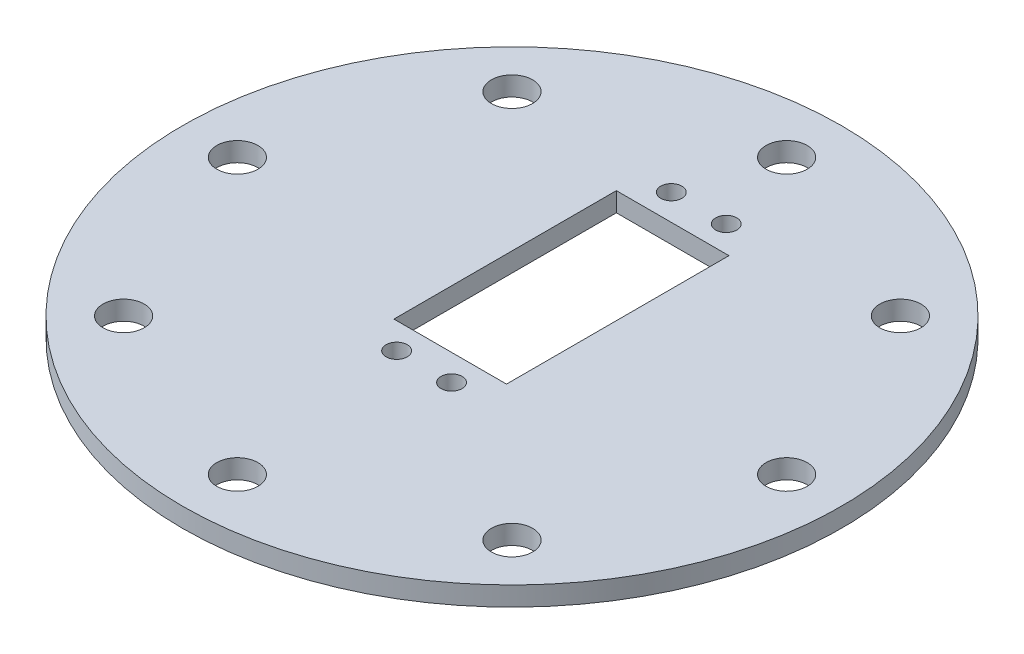
ISO-10303-21;
HEADER;
FILE_DESCRIPTION(('STEP AP214'),'2;1');
FILE_NAME('part.step','',(''),(''),'','','');
FILE_SCHEMA(('AUTOMOTIVE_DESIGN { 1 0 10303 214 1 1 1 1 }'));
ENDSEC;
DATA;
#1=APPLICATION_CONTEXT('core data for automotive mechanical design processes');
#2=APPLICATION_PROTOCOL_DEFINITION('international standard','automotive_design',2000,#1);
#3=PRODUCT_CONTEXT('',#1,'mechanical');
#4=PRODUCT('Part','Part','',(#3));
#5=PRODUCT_RELATED_PRODUCT_CATEGORY('part','',(#4));
#6=PRODUCT_DEFINITION_FORMATION('','',#4);
#7=PRODUCT_DEFINITION_CONTEXT('part definition',#1,'design');
#8=PRODUCT_DEFINITION('design','',#6,#7);
#9=PRODUCT_DEFINITION_SHAPE('','',#8);
#10=(LENGTH_UNIT() NAMED_UNIT(*) SI_UNIT(.MILLI.,.METRE.));
#11=(NAMED_UNIT(*) PLANE_ANGLE_UNIT() SI_UNIT($,.RADIAN.));
#12=(NAMED_UNIT(*) SI_UNIT($,.STERADIAN.) SOLID_ANGLE_UNIT());
#13=UNCERTAINTY_MEASURE_WITH_UNIT(LENGTH_MEASURE(1.E-05),#10,'distance_accuracy_value','');
#14=(GEOMETRIC_REPRESENTATION_CONTEXT(3) GLOBAL_UNCERTAINTY_ASSIGNED_CONTEXT((#13)) GLOBAL_UNIT_ASSIGNED_CONTEXT((#10,
#11,#12)) REPRESENTATION_CONTEXT('',''));
#15=CARTESIAN_POINT('',(0.,0.,0.));
#16=DIRECTION('',(0.,0.,1.));
#17=DIRECTION('',(1.,0.,0.));
#18=AXIS2_PLACEMENT_3D('',#15,#16,#17);
#19=CARTESIAN_POINT('',(0.,3.5,0.));
#20=DIRECTION('',(0.,-1.,0.));
#21=DIRECTION('',(0.,0.,-1.));
#22=AXIS2_PLACEMENT_3D('',#19,#20,#21);
#23=CYLINDRICAL_SURFACE('',#22,60.);
#24=CARTESIAN_POINT('',(0.,3.5,0.));
#25=DIRECTION('',(0.,1.,0.));
#26=DIRECTION('',(0.,0.,1.));
#27=AXIS2_PLACEMENT_3D('',#24,#25,#26);
#28=CIRCLE('',#27,60.);
#29=CARTESIAN_POINT('',(0.,3.5,60.));
#30=VERTEX_POINT('',#29);
#31=EDGE_CURVE('E11',#30,#30,#28,.T.);
#32=ORIENTED_EDGE('',*,*,#31,.F.);
#33=EDGE_LOOP('',(#32));
#34=FACE_BOUND('',#33,.T.);
#35=CARTESIAN_POINT('',(0.,0.,0.));
#36=DIRECTION('',(0.,1.,0.));
#37=DIRECTION('',(0.,0.,1.));
#38=AXIS2_PLACEMENT_3D('',#35,#36,#37);
#39=CIRCLE('',#38,60.);
#40=CARTESIAN_POINT('',(0.,0.,60.));
#41=VERTEX_POINT('',#40);
#42=EDGE_CURVE('E46',#41,#41,#39,.T.);
#43=ORIENTED_EDGE('',*,*,#42,.T.);
#44=EDGE_LOOP('',(#43));
#45=FACE_BOUND('',#44,.T.);
#46=ADVANCED_FACE('F43',(#34,#45),#23,.T.);
#47=CARTESIAN_POINT('',(0.,3.5,0.));
#48=DIRECTION('',(0.,1.,0.));
#49=DIRECTION('',(0.,0.,1.));
#50=AXIS2_PLACEMENT_3D('',#47,#48,#49);
#51=PLANE('',#50);
#52=DIRECTION('',(0.,0.,-1.));
#53=VECTOR('',#52,1.);
#54=CARTESIAN_POINT('',(10.25,3.5,-29.25));
#55=LINE('',#54,#53);
#56=CARTESIAN_POINT('',(10.25,3.5,11.25));
#57=VERTEX_POINT('',#56);
#58=CARTESIAN_POINT('',(10.25,3.5,-29.25));
#59=VERTEX_POINT('',#58);
#60=EDGE_CURVE('E58',#57,#59,#55,.T.);
#61=ORIENTED_EDGE('',*,*,#60,.F.);
#62=DIRECTION('',(1.,0.,0.));
#63=VECTOR('',#62,1.);
#64=CARTESIAN_POINT('',(-10.25,3.5,11.25));
#65=LINE('',#64,#63);
#66=CARTESIAN_POINT('',(-10.25,3.5,11.25));
#67=VERTEX_POINT('',#66);
#68=EDGE_CURVE('E93',#67,#57,#65,.T.);
#69=ORIENTED_EDGE('',*,*,#68,.F.);
#70=DIRECTION('',(0.,0.,1.));
#71=VECTOR('',#70,1.);
#72=CARTESIAN_POINT('',(-10.25,3.5,-29.25));
#73=LINE('',#72,#71);
#74=CARTESIAN_POINT('',(-10.25,3.5,-29.25));
#75=VERTEX_POINT('',#74);
#76=EDGE_CURVE('E118',#75,#67,#73,.T.);
#77=ORIENTED_EDGE('',*,*,#76,.F.);
#78=DIRECTION('',(-1.,0.,0.));
#79=VECTOR('',#78,1.);
#80=CARTESIAN_POINT('',(-10.25,3.5,-29.25));
#81=LINE('',#80,#79);
#82=EDGE_CURVE('E111',#59,#75,#81,.T.);
#83=ORIENTED_EDGE('',*,*,#82,.F.);
#84=EDGE_LOOP('',(#61,#69,#77,#83));
#85=FACE_BOUND('',#84,.T.);
#86=CARTESIAN_POINT('',(5.00000000000004,3.5,16.));
#87=DIRECTION('',(0.,1.,0.));
#88=DIRECTION('',(0.,0.,-1.));
#89=AXIS2_PLACEMENT_3D('',#86,#87,#88);
#90=CIRCLE('',#89,1.92644479036685);
#91=CARTESIAN_POINT('',(5.00000000000004,3.5,14.0735552096331));
#92=VERTEX_POINT('',#91);
#93=EDGE_CURVE('E144',#92,#92,#90,.T.);
#94=ORIENTED_EDGE('',*,*,#93,.F.);
#95=EDGE_LOOP('',(#94));
#96=FACE_BOUND('',#95,.T.);
#97=CARTESIAN_POINT('',(-4.99999999999998,3.5,-34.));
#98=DIRECTION('',(0.,1.,0.));
#99=DIRECTION('',(0.,0.,-1.));
#100=AXIS2_PLACEMENT_3D('',#97,#98,#99);
#101=CIRCLE('',#100,1.92644479036685);
#102=CARTESIAN_POINT('',(-4.99999999999998,3.5,-35.9264447903669));
#103=VERTEX_POINT('',#102);
#104=EDGE_CURVE('E145',#103,#103,#101,.T.);
#105=ORIENTED_EDGE('',*,*,#104,.F.);
#106=EDGE_LOOP('',(#105));
#107=FACE_BOUND('',#106,.T.);
#108=CARTESIAN_POINT('',(-4.99999999999996,3.5,16.));
#109=DIRECTION('',(0.,1.,0.));
#110=DIRECTION('',(0.,0.,1.));
#111=AXIS2_PLACEMENT_3D('',#108,#109,#110);
#112=CIRCLE('',#111,1.92644479036685);
#113=CARTESIAN_POINT('',(-4.99999999999996,3.5,17.9264447903669));
#114=VERTEX_POINT('',#113);
#115=EDGE_CURVE('E135',#114,#114,#112,.T.);
#116=ORIENTED_EDGE('',*,*,#115,.F.);
#117=EDGE_LOOP('',(#116));
#118=FACE_BOUND('',#117,.T.);
#119=CARTESIAN_POINT('',(5.,3.5,-34.));
#120=DIRECTION('',(0.,1.,0.));
#121=DIRECTION('',(0.,0.,1.));
#122=AXIS2_PLACEMENT_3D('',#119,#120,#121);
#123=CIRCLE('',#122,1.92644479036685);
#124=CARTESIAN_POINT('',(5.,3.5,-32.0735552096332));
#125=VERTEX_POINT('',#124);
#126=EDGE_CURVE('E149',#125,#125,#123,.T.);
#127=ORIENTED_EDGE('',*,*,#126,.F.);
#128=EDGE_LOOP('',(#127));
#129=FACE_BOUND('',#128,.T.);
#130=CARTESIAN_POINT('',(-50.,3.5,1.74574066942157E-13));
#131=DIRECTION('',(0.,1.,0.));
#132=DIRECTION('',(1.,0.,0.));
#133=AXIS2_PLACEMENT_3D('',#130,#131,#132);
#134=CIRCLE('',#133,3.75);
#135=CARTESIAN_POINT('',(-46.25,3.5,1.61481011921495E-13));
#136=VERTEX_POINT('',#135);
#137=EDGE_CURVE('E180',#136,#136,#134,.T.);
#138=ORIENTED_EDGE('',*,*,#137,.F.);
#139=EDGE_LOOP('',(#138));
#140=FACE_BOUND('',#139,.T.);
#141=CARTESIAN_POINT('',(-35.3553390593272,3.5,35.3553390593276));
#142=DIRECTION('',(0.,1.,0.));
#143=DIRECTION('',(0.707106781186544,0.,-0.707106781186551));
#144=AXIS2_PLACEMENT_3D('',#141,#142,#143);
#145=CIRCLE('',#144,3.75);
#146=CARTESIAN_POINT('',(-32.7036886298777,3.5,32.703688629878));
#147=VERTEX_POINT('',#146);
#148=EDGE_CURVE('E190',#147,#147,#145,.T.);
#149=ORIENTED_EDGE('',*,*,#148,.F.);
#150=EDGE_LOOP('',(#149));
#151=FACE_BOUND('',#150,.T.);
#152=CARTESIAN_POINT('',(0.,3.5,50.));
#153=DIRECTION('',(0.,1.,0.));
#154=DIRECTION('',(0.,0.,-1.));
#155=AXIS2_PLACEMENT_3D('',#152,#153,#154);
#156=CIRCLE('',#155,3.75);
#157=CARTESIAN_POINT('',(0.,3.5,46.25));
#158=VERTEX_POINT('',#157);
#159=EDGE_CURVE('E198',#158,#158,#156,.T.);
#160=ORIENTED_EDGE('',*,*,#159,.F.);
#161=EDGE_LOOP('',(#160));
#162=FACE_BOUND('',#161,.T.);
#163=CARTESIAN_POINT('',(35.3553390593277,3.5,35.3553390593271));
#164=DIRECTION('',(0.,1.,0.));
#165=DIRECTION('',(-0.707106781186554,0.,-0.707106781186541));
#166=AXIS2_PLACEMENT_3D('',#163,#164,#165);
#167=CIRCLE('',#166,3.75);
#168=CARTESIAN_POINT('',(32.7036886298781,3.5,32.7036886298775));
#169=VERTEX_POINT('',#168);
#170=EDGE_CURVE('E173',#169,#169,#167,.T.);
#171=ORIENTED_EDGE('',*,*,#170,.F.);
#172=EDGE_LOOP('',(#171));
#173=FACE_BOUND('',#172,.T.);
#174=CARTESIAN_POINT('',(50.,3.5,-5.2372220082647E-13));
#175=DIRECTION('',(0.,1.,0.));
#176=DIRECTION('',(-1.,0.,0.));
#177=AXIS2_PLACEMENT_3D('',#174,#175,#176);
#178=CIRCLE('',#177,3.75);
#179=CARTESIAN_POINT('',(46.25,3.5,-4.84443035764485E-13));
#180=VERTEX_POINT('',#179);
#181=EDGE_CURVE('E164',#180,#180,#178,.T.);
#182=ORIENTED_EDGE('',*,*,#181,.F.);
#183=EDGE_LOOP('',(#182));
#184=FACE_BOUND('',#183,.T.);
#185=CARTESIAN_POINT('',(35.3553390593269,3.5,-35.3553390593278));
#186=DIRECTION('',(0.,1.,0.));
#187=DIRECTION('',(-0.707106781186539,0.,0.707106781186556));
#188=AXIS2_PLACEMENT_3D('',#185,#186,#187);
#189=CIRCLE('',#188,3.75);
#190=CARTESIAN_POINT('',(32.7036886298774,3.5,-32.7036886298782));
#191=VERTEX_POINT('',#190);
#192=EDGE_CURVE('E163',#191,#191,#189,.T.);
#193=ORIENTED_EDGE('',*,*,#192,.F.);
#194=EDGE_LOOP('',(#193));
#195=FACE_BOUND('',#194,.T.);
#196=CARTESIAN_POINT('',(-35.3553390593274,3.5,-35.3553390593273));
#197=DIRECTION('',(0.,1.,0.));
#198=DIRECTION('',(0.707106781186549,0.,0.707106781186546));
#199=AXIS2_PLACEMENT_3D('',#196,#197,#198);
#200=CIRCLE('',#199,3.75);
#201=CARTESIAN_POINT('',(-32.7036886298779,3.5,-32.7036886298778));
#202=VERTEX_POINT('',#201);
#203=EDGE_CURVE('E189',#202,#202,#200,.T.);
#204=ORIENTED_EDGE('',*,*,#203,.F.);
#205=EDGE_LOOP('',(#204));
#206=FACE_BOUND('',#205,.T.);
#207=CARTESIAN_POINT('',(0.,3.5,-50.));
#208=DIRECTION('',(0.,1.,0.));
#209=DIRECTION('',(0.,0.,1.));
#210=AXIS2_PLACEMENT_3D('',#207,#208,#209);
#211=CIRCLE('',#210,3.75);
#212=CARTESIAN_POINT('',(0.,3.5,-46.25));
#213=VERTEX_POINT('',#212);
#214=EDGE_CURVE('E219',#213,#213,#211,.T.);
#215=ORIENTED_EDGE('',*,*,#214,.F.);
#216=EDGE_LOOP('',(#215));
#217=FACE_BOUND('',#216,.T.);
#218=ORIENTED_EDGE('',*,*,#31,.T.);
#219=EDGE_LOOP('',(#218));
#220=FACE_BOUND('',#219,.T.);
#221=ADVANCED_FACE('F235',(#85,#96,#107,#118,#129,#140,#151,#162,#173,#184,#195,#206,#217,#220),
#51,.T.);
#222=CARTESIAN_POINT('',(0.,0.,0.));
#223=DIRECTION('',(0.,1.,0.));
#224=DIRECTION('',(0.,0.,1.));
#225=AXIS2_PLACEMENT_3D('',#222,#223,#224);
#226=PLANE('',#225);
#227=DIRECTION('',(-1.,0.,0.));
#228=VECTOR('',#227,1.);
#229=CARTESIAN_POINT('',(-10.25,0.,11.25));
#230=LINE('',#229,#228);
#231=CARTESIAN_POINT('',(10.25,0.,11.25));
#232=VERTEX_POINT('',#231);
#233=CARTESIAN_POINT('',(-10.25,0.,11.25));
#234=VERTEX_POINT('',#233);
#235=EDGE_CURVE('E106',#232,#234,#230,.T.);
#236=ORIENTED_EDGE('',*,*,#235,.F.);
#237=DIRECTION('',(0.,0.,1.));
#238=VECTOR('',#237,1.);
#239=CARTESIAN_POINT('',(10.25,0.,-29.25));
#240=LINE('',#239,#238);
#241=CARTESIAN_POINT('',(10.25,0.,-29.25));
#242=VERTEX_POINT('',#241);
#243=EDGE_CURVE('E86',#242,#232,#240,.T.);
#244=ORIENTED_EDGE('',*,*,#243,.F.);
#245=DIRECTION('',(1.,0.,0.));
#246=VECTOR('',#245,1.);
#247=CARTESIAN_POINT('',(-10.25,0.,-29.25));
#248=LINE('',#247,#246);
#249=CARTESIAN_POINT('',(-10.25,0.,-29.25));
#250=VERTEX_POINT('',#249);
#251=EDGE_CURVE('E96',#250,#242,#248,.T.);
#252=ORIENTED_EDGE('',*,*,#251,.F.);
#253=DIRECTION('',(0.,0.,-1.));
#254=VECTOR('',#253,1.);
#255=CARTESIAN_POINT('',(-10.25,0.,-29.25));
#256=LINE('',#255,#254);
#257=EDGE_CURVE('E66',#234,#250,#256,.T.);
#258=ORIENTED_EDGE('',*,*,#257,.F.);
#259=EDGE_LOOP('',(#236,#244,#252,#258));
#260=FACE_BOUND('',#259,.T.);
#261=CARTESIAN_POINT('',(5.00000000000004,0.,16.));
#262=DIRECTION('',(0.,1.,0.));
#263=DIRECTION('',(0.,0.,1.));
#264=AXIS2_PLACEMENT_3D('',#261,#262,#263);
#265=CIRCLE('',#264,1.92644479036685);
#266=CARTESIAN_POINT('',(5.00000000000004,0.,17.9264447903668));
#267=VERTEX_POINT('',#266);
#268=EDGE_CURVE('E140',#267,#267,#265,.F.);
#269=ORIENTED_EDGE('',*,*,#268,.F.);
#270=EDGE_LOOP('',(#269));
#271=FACE_BOUND('',#270,.T.);
#272=CARTESIAN_POINT('',(-4.99999999999998,0.,-34.));
#273=DIRECTION('',(0.,1.,0.));
#274=DIRECTION('',(0.,0.,1.));
#275=AXIS2_PLACEMENT_3D('',#272,#273,#274);
#276=CIRCLE('',#275,1.92644479036685);
#277=CARTESIAN_POINT('',(-4.99999999999998,0.,-32.0735552096332));
#278=VERTEX_POINT('',#277);
#279=EDGE_CURVE('E139',#278,#278,#276,.F.);
#280=ORIENTED_EDGE('',*,*,#279,.F.);
#281=EDGE_LOOP('',(#280));
#282=FACE_BOUND('',#281,.T.);
#283=CARTESIAN_POINT('',(-4.99999999999996,0.,16.));
#284=DIRECTION('',(0.,1.,0.));
#285=DIRECTION('',(0.,0.,1.));
#286=AXIS2_PLACEMENT_3D('',#283,#284,#285);
#287=CIRCLE('',#286,1.92644479036685);
#288=CARTESIAN_POINT('',(-4.99999999999996,0.,17.9264447903669));
#289=VERTEX_POINT('',#288);
#290=EDGE_CURVE('E100',#289,#289,#287,.F.);
#291=ORIENTED_EDGE('',*,*,#290,.F.);
#292=EDGE_LOOP('',(#291));
#293=FACE_BOUND('',#292,.T.);
#294=CARTESIAN_POINT('',(5.,0.,-34.));
#295=DIRECTION('',(0.,1.,0.));
#296=DIRECTION('',(0.,0.,1.));
#297=AXIS2_PLACEMENT_3D('',#294,#295,#296);
#298=CIRCLE('',#297,1.92644479036685);
#299=CARTESIAN_POINT('',(5.,0.,-32.0735552096332));
#300=VERTEX_POINT('',#299);
#301=EDGE_CURVE('E159',#300,#300,#298,.F.);
#302=ORIENTED_EDGE('',*,*,#301,.F.);
#303=EDGE_LOOP('',(#302));
#304=FACE_BOUND('',#303,.T.);
#305=CARTESIAN_POINT('',(-50.,0.,1.74574066942157E-13));
#306=DIRECTION('',(0.,1.,0.));
#307=DIRECTION('',(0.,0.,1.));
#308=AXIS2_PLACEMENT_3D('',#305,#306,#307);
#309=CIRCLE('',#308,3.75);
#310=CARTESIAN_POINT('',(-50.,0.,3.75000000000018));
#311=VERTEX_POINT('',#310);
#312=EDGE_CURVE('E184',#311,#311,#309,.F.);
#313=ORIENTED_EDGE('',*,*,#312,.F.);
#314=EDGE_LOOP('',(#313));
#315=FACE_BOUND('',#314,.T.);
#316=CARTESIAN_POINT('',(-35.3553390593272,0.,35.3553390593276));
#317=DIRECTION('',(0.,1.,0.));
#318=DIRECTION('',(0.,0.,1.));
#319=AXIS2_PLACEMENT_3D('',#316,#317,#318);
#320=CIRCLE('',#319,3.75);
#321=CARTESIAN_POINT('',(-35.3553390593272,0.,39.1053390593276));
#322=VERTEX_POINT('',#321);
#323=EDGE_CURVE('E185',#322,#322,#320,.F.);
#324=ORIENTED_EDGE('',*,*,#323,.F.);
#325=EDGE_LOOP('',(#324));
#326=FACE_BOUND('',#325,.T.);
#327=CARTESIAN_POINT('',(0.,0.,50.));
#328=DIRECTION('',(0.,1.,0.));
#329=DIRECTION('',(0.,0.,1.));
#330=AXIS2_PLACEMENT_3D('',#327,#328,#329);
#331=CIRCLE('',#330,3.75);
#332=CARTESIAN_POINT('',(0.,0.,53.75));
#333=VERTEX_POINT('',#332);
#334=EDGE_CURVE('E194',#333,#333,#331,.F.);
#335=ORIENTED_EDGE('',*,*,#334,.F.);
#336=EDGE_LOOP('',(#335));
#337=FACE_BOUND('',#336,.T.);
#338=CARTESIAN_POINT('',(35.3553390593277,0.,35.3553390593271));
#339=DIRECTION('',(0.,1.,0.));
#340=DIRECTION('',(0.,0.,1.));
#341=AXIS2_PLACEMENT_3D('',#338,#339,#340);
#342=CIRCLE('',#341,3.75);
#343=CARTESIAN_POINT('',(35.3553390593277,0.,39.1053390593271));
#344=VERTEX_POINT('',#343);
#345=EDGE_CURVE('E202',#344,#344,#342,.F.);
#346=ORIENTED_EDGE('',*,*,#345,.F.);
#347=EDGE_LOOP('',(#346));
#348=FACE_BOUND('',#347,.T.);
#349=CARTESIAN_POINT('',(50.,0.,-5.2372220082647E-13));
#350=DIRECTION('',(0.,1.,0.));
#351=DIRECTION('',(0.,0.,1.));
#352=AXIS2_PLACEMENT_3D('',#349,#350,#351);
#353=CIRCLE('',#352,3.75);
#354=CARTESIAN_POINT('',(50.,0.,3.74999999999948));
#355=VERTEX_POINT('',#354);
#356=EDGE_CURVE('E168',#355,#355,#353,.F.);
#357=ORIENTED_EDGE('',*,*,#356,.F.);
#358=EDGE_LOOP('',(#357));
#359=FACE_BOUND('',#358,.T.);
#360=CARTESIAN_POINT('',(35.3553390593269,0.,-35.3553390593278));
#361=DIRECTION('',(0.,1.,0.));
#362=DIRECTION('',(0.,0.,1.));
#363=AXIS2_PLACEMENT_3D('',#360,#361,#362);
#364=CIRCLE('',#363,3.75);
#365=CARTESIAN_POINT('',(35.3553390593269,0.,-31.6053390593278));
#366=VERTEX_POINT('',#365);
#367=EDGE_CURVE('E169',#366,#366,#364,.F.);
#368=ORIENTED_EDGE('',*,*,#367,.F.);
#369=EDGE_LOOP('',(#368));
#370=FACE_BOUND('',#369,.T.);
#371=CARTESIAN_POINT('',(-35.3553390593274,0.,-35.3553390593273));
#372=DIRECTION('',(0.,1.,0.));
#373=DIRECTION('',(0.,0.,1.));
#374=AXIS2_PLACEMENT_3D('',#371,#372,#373);
#375=CIRCLE('',#374,3.75);
#376=CARTESIAN_POINT('',(-35.3553390593274,0.,-31.6053390593273));
#377=VERTEX_POINT('',#376);
#378=EDGE_CURVE('E215',#377,#377,#375,.F.);
#379=ORIENTED_EDGE('',*,*,#378,.F.);
#380=EDGE_LOOP('',(#379));
#381=FACE_BOUND('',#380,.T.);
#382=CARTESIAN_POINT('',(0.,0.,-50.));
#383=DIRECTION('',(0.,1.,0.));
#384=DIRECTION('',(0.,0.,1.));
#385=AXIS2_PLACEMENT_3D('',#382,#383,#384);
#386=CIRCLE('',#385,3.75);
#387=CARTESIAN_POINT('',(0.,0.,-46.25));
#388=VERTEX_POINT('',#387);
#389=EDGE_CURVE('E223',#388,#388,#386,.F.);
#390=ORIENTED_EDGE('',*,*,#389,.F.);
#391=EDGE_LOOP('',(#390));
#392=FACE_BOUND('',#391,.T.);
#393=ORIENTED_EDGE('',*,*,#42,.F.);
#394=EDGE_LOOP('',(#393));
#395=FACE_BOUND('',#394,.T.);
#396=ADVANCED_FACE('F103',(#260,#271,#282,#293,#304,#315,#326,#337,#348,#359,#370,#381,#392,
#395),#226,.F.);
#397=CARTESIAN_POINT('',(0.,-0.00100000000000013,-50.));
#398=DIRECTION('',(0.,1.,0.));
#399=DIRECTION('',(0.,0.,1.));
#400=AXIS2_PLACEMENT_3D('',#397,#398,#399);
#401=CYLINDRICAL_SURFACE('',#400,3.75);
#402=ORIENTED_EDGE('',*,*,#214,.T.);
#403=EDGE_LOOP('',(#402));
#404=FACE_BOUND('',#403,.T.);
#405=ORIENTED_EDGE('',*,*,#389,.T.);
#406=EDGE_LOOP('',(#405));
#407=FACE_BOUND('',#406,.T.);
#408=ADVANCED_FACE('F234',(#404,#407),#401,.F.);
#409=CARTESIAN_POINT('',(-35.3553390593274,-0.00100000000000013,-35.3553390593273));
#410=DIRECTION('',(0.,1.,0.));
#411=DIRECTION('',(0.,0.,1.));
#412=AXIS2_PLACEMENT_3D('',#409,#410,#411);
#413=CYLINDRICAL_SURFACE('',#412,3.75);
#414=ORIENTED_EDGE('',*,*,#203,.T.);
#415=EDGE_LOOP('',(#414));
#416=FACE_BOUND('',#415,.T.);
#417=ORIENTED_EDGE('',*,*,#378,.T.);
#418=EDGE_LOOP('',(#417));
#419=FACE_BOUND('',#418,.T.);
#420=ADVANCED_FACE('F240',(#416,#419),#413,.F.);
#421=CARTESIAN_POINT('',(35.3553390593269,-0.00100000000000013,-35.3553390593278));
#422=DIRECTION('',(0.,1.,0.));
#423=DIRECTION('',(0.,0.,1.));
#424=AXIS2_PLACEMENT_3D('',#421,#422,#423);
#425=CYLINDRICAL_SURFACE('',#424,3.75);
#426=ORIENTED_EDGE('',*,*,#192,.T.);
#427=EDGE_LOOP('',(#426));
#428=FACE_BOUND('',#427,.T.);
#429=ORIENTED_EDGE('',*,*,#367,.T.);
#430=EDGE_LOOP('',(#429));
#431=FACE_BOUND('',#430,.T.);
#432=ADVANCED_FACE('F397',(#428,#431),#425,.F.);
#433=CARTESIAN_POINT('',(50.,-0.00100000000000013,-5.2372220082647E-13));
#434=DIRECTION('',(0.,1.,0.));
#435=DIRECTION('',(0.,0.,1.));
#436=AXIS2_PLACEMENT_3D('',#433,#434,#435);
#437=CYLINDRICAL_SURFACE('',#436,3.75);
#438=ORIENTED_EDGE('',*,*,#181,.T.);
#439=EDGE_LOOP('',(#438));
#440=FACE_BOUND('',#439,.T.);
#441=ORIENTED_EDGE('',*,*,#356,.T.);
#442=EDGE_LOOP('',(#441));
#443=FACE_BOUND('',#442,.T.);
#444=ADVANCED_FACE('F387',(#440,#443),#437,.F.);
#445=CARTESIAN_POINT('',(35.3553390593277,-0.00100000000000013,35.3553390593271));
#446=DIRECTION('',(0.,1.,0.));
#447=DIRECTION('',(0.,0.,1.));
#448=AXIS2_PLACEMENT_3D('',#445,#446,#447);
#449=CYLINDRICAL_SURFACE('',#448,3.75);
#450=ORIENTED_EDGE('',*,*,#170,.T.);
#451=EDGE_LOOP('',(#450));
#452=FACE_BOUND('',#451,.T.);
#453=ORIENTED_EDGE('',*,*,#345,.T.);
#454=EDGE_LOOP('',(#453));
#455=FACE_BOUND('',#454,.T.);
#456=ADVANCED_FACE('F377',(#452,#455),#449,.F.);
#457=CARTESIAN_POINT('',(0.,-0.00100000000000013,50.));
#458=DIRECTION('',(0.,1.,0.));
#459=DIRECTION('',(0.,0.,1.));
#460=AXIS2_PLACEMENT_3D('',#457,#458,#459);
#461=CYLINDRICAL_SURFACE('',#460,3.75);
#462=ORIENTED_EDGE('',*,*,#159,.T.);
#463=EDGE_LOOP('',(#462));
#464=FACE_BOUND('',#463,.T.);
#465=ORIENTED_EDGE('',*,*,#334,.T.);
#466=EDGE_LOOP('',(#465));
#467=FACE_BOUND('',#466,.T.);
#468=ADVANCED_FACE('F367',(#464,#467),#461,.F.);
#469=CARTESIAN_POINT('',(-35.3553390593272,-0.00100000000000013,35.3553390593276));
#470=DIRECTION('',(0.,1.,0.));
#471=DIRECTION('',(0.,0.,1.));
#472=AXIS2_PLACEMENT_3D('',#469,#470,#471);
#473=CYLINDRICAL_SURFACE('',#472,3.75);
#474=ORIENTED_EDGE('',*,*,#148,.T.);
#475=EDGE_LOOP('',(#474));
#476=FACE_BOUND('',#475,.T.);
#477=ORIENTED_EDGE('',*,*,#323,.T.);
#478=EDGE_LOOP('',(#477));
#479=FACE_BOUND('',#478,.T.);
#480=ADVANCED_FACE('F357',(#476,#479),#473,.F.);
#481=CARTESIAN_POINT('',(-50.,-0.00100000000000013,1.74574066942157E-13));
#482=DIRECTION('',(0.,1.,0.));
#483=DIRECTION('',(0.,0.,1.));
#484=AXIS2_PLACEMENT_3D('',#481,#482,#483);
#485=CYLINDRICAL_SURFACE('',#484,3.75);
#486=ORIENTED_EDGE('',*,*,#137,.T.);
#487=EDGE_LOOP('',(#486));
#488=FACE_BOUND('',#487,.T.);
#489=ORIENTED_EDGE('',*,*,#312,.T.);
#490=EDGE_LOOP('',(#489));
#491=FACE_BOUND('',#490,.T.);
#492=ADVANCED_FACE('F347',(#488,#491),#485,.F.);
#493=CARTESIAN_POINT('',(5.,-0.00100000000000013,-34.));
#494=DIRECTION('',(0.,1.,0.));
#495=DIRECTION('',(0.,0.,1.));
#496=AXIS2_PLACEMENT_3D('',#493,#494,#495);
#497=CYLINDRICAL_SURFACE('',#496,1.92644479036685);
#498=ORIENTED_EDGE('',*,*,#126,.T.);
#499=EDGE_LOOP('',(#498));
#500=FACE_BOUND('',#499,.T.);
#501=ORIENTED_EDGE('',*,*,#301,.T.);
#502=EDGE_LOOP('',(#501));
#503=FACE_BOUND('',#502,.T.);
#504=ADVANCED_FACE('F337',(#500,#503),#497,.F.);
#505=CARTESIAN_POINT('',(-4.99999999999996,-0.00100000000000013,16.));
#506=DIRECTION('',(0.,1.,0.));
#507=DIRECTION('',(0.,0.,1.));
#508=AXIS2_PLACEMENT_3D('',#505,#506,#507);
#509=CYLINDRICAL_SURFACE('',#508,1.92644479036685);
#510=ORIENTED_EDGE('',*,*,#115,.T.);
#511=EDGE_LOOP('',(#510));
#512=FACE_BOUND('',#511,.T.);
#513=ORIENTED_EDGE('',*,*,#290,.T.);
#514=EDGE_LOOP('',(#513));
#515=FACE_BOUND('',#514,.T.);
#516=ADVANCED_FACE('F328',(#512,#515),#509,.F.);
#517=CARTESIAN_POINT('',(-4.99999999999998,-0.00100000000000013,-34.));
#518=DIRECTION('',(0.,1.,0.));
#519=DIRECTION('',(0.,0.,1.));
#520=AXIS2_PLACEMENT_3D('',#517,#518,#519);
#521=CYLINDRICAL_SURFACE('',#520,1.92644479036685);
#522=ORIENTED_EDGE('',*,*,#104,.T.);
#523=EDGE_LOOP('',(#522));
#524=FACE_BOUND('',#523,.T.);
#525=ORIENTED_EDGE('',*,*,#279,.T.);
#526=EDGE_LOOP('',(#525));
#527=FACE_BOUND('',#526,.T.);
#528=ADVANCED_FACE('F319',(#524,#527),#521,.F.);
#529=CARTESIAN_POINT('',(5.00000000000004,-0.00100000000000013,16.));
#530=DIRECTION('',(0.,1.,0.));
#531=DIRECTION('',(0.,0.,1.));
#532=AXIS2_PLACEMENT_3D('',#529,#530,#531);
#533=CYLINDRICAL_SURFACE('',#532,1.92644479036685);
#534=ORIENTED_EDGE('',*,*,#93,.T.);
#535=EDGE_LOOP('',(#534));
#536=FACE_BOUND('',#535,.T.);
#537=ORIENTED_EDGE('',*,*,#268,.T.);
#538=EDGE_LOOP('',(#537));
#539=FACE_BOUND('',#538,.T.);
#540=ADVANCED_FACE('F263',(#536,#539),#533,.F.);
#541=CARTESIAN_POINT('',(10.25,-0.00100000000000013,-29.25));
#542=DIRECTION('',(1.,0.,0.));
#543=DIRECTION('',(0.,0.,-1.));
#544=AXIS2_PLACEMENT_3D('',#541,#542,#543);
#545=PLANE('',#544);
#546=ORIENTED_EDGE('',*,*,#243,.T.);
#547=DIRECTION('',(0.,1.,0.));
#548=VECTOR('',#547,1.);
#549=CARTESIAN_POINT('',(10.25,-0.00100000000000013,11.25));
#550=LINE('',#549,#548);
#551=EDGE_CURVE('E101',#232,#57,#550,.T.);
#552=ORIENTED_EDGE('',*,*,#551,.T.);
#553=ORIENTED_EDGE('',*,*,#60,.T.);
#554=DIRECTION('',(0.,1.,0.));
#555=VECTOR('',#554,1.);
#556=CARTESIAN_POINT('',(10.25,-0.00100000000000013,-29.25));
#557=LINE('',#556,#555);
#558=EDGE_CURVE('E82',#242,#59,#557,.T.);
#559=ORIENTED_EDGE('',*,*,#558,.F.);
#560=EDGE_LOOP('',(#546,#552,#553,#559));
#561=FACE_BOUND('',#560,.T.);
#562=ADVANCED_FACE('F84',(#561),#545,.F.);
#563=CARTESIAN_POINT('',(-10.25,-0.00100000000000013,11.25));
#564=DIRECTION('',(0.,0.,1.));
#565=DIRECTION('',(1.,0.,0.));
#566=AXIS2_PLACEMENT_3D('',#563,#564,#565);
#567=PLANE('',#566);
#568=ORIENTED_EDGE('',*,*,#235,.T.);
#569=DIRECTION('',(0.,1.,0.));
#570=VECTOR('',#569,1.);
#571=CARTESIAN_POINT('',(-10.25,-0.00100000000000013,11.25));
#572=LINE('',#571,#570);
#573=EDGE_CURVE('E127',#234,#67,#572,.T.);
#574=ORIENTED_EDGE('',*,*,#573,.T.);
#575=ORIENTED_EDGE('',*,*,#68,.T.);
#576=ORIENTED_EDGE('',*,*,#551,.F.);
#577=EDGE_LOOP('',(#568,#574,#575,#576));
#578=FACE_BOUND('',#577,.T.);
#579=ADVANCED_FACE('F278',(#578),#567,.F.);
#580=CARTESIAN_POINT('',(-10.25,-0.00100000000000013,-29.25));
#581=DIRECTION('',(-1.,0.,0.));
#582=DIRECTION('',(0.,0.,1.));
#583=AXIS2_PLACEMENT_3D('',#580,#581,#582);
#584=PLANE('',#583);
#585=ORIENTED_EDGE('',*,*,#257,.T.);
#586=DIRECTION('',(0.,1.,0.));
#587=VECTOR('',#586,1.);
#588=CARTESIAN_POINT('',(-10.25,-0.00100000000000013,-29.25));
#589=LINE('',#588,#587);
#590=EDGE_CURVE('E92',#250,#75,#589,.T.);
#591=ORIENTED_EDGE('',*,*,#590,.T.);
#592=ORIENTED_EDGE('',*,*,#76,.T.);
#593=ORIENTED_EDGE('',*,*,#573,.F.);
#594=EDGE_LOOP('',(#585,#591,#592,#593));
#595=FACE_BOUND('',#594,.T.);
#596=ADVANCED_FACE('F288',(#595),#584,.F.);
#597=CARTESIAN_POINT('',(-10.25,-0.00100000000000013,-29.25));
#598=DIRECTION('',(0.,0.,-1.));
#599=DIRECTION('',(-1.,0.,0.));
#600=AXIS2_PLACEMENT_3D('',#597,#598,#599);
#601=PLANE('',#600);
#602=ORIENTED_EDGE('',*,*,#251,.T.);
#603=ORIENTED_EDGE('',*,*,#558,.T.);
#604=ORIENTED_EDGE('',*,*,#82,.T.);
#605=ORIENTED_EDGE('',*,*,#590,.F.);
#606=EDGE_LOOP('',(#602,#603,#604,#605));
#607=FACE_BOUND('',#606,.T.);
#608=ADVANCED_FACE('F97',(#607),#601,.F.);
#609=CLOSED_SHELL('',(#46,#221,#396,#408,#420,#432,#444,#456,#468,#480,#492,#504,#516,#528,#540,
#562,#579,#596,#608));
#610=MANIFOLD_SOLID_BREP('B2',#609);
#611=ADVANCED_BREP_SHAPE_REPRESENTATION('',(#18,#610),#14);
#612=SHAPE_DEFINITION_REPRESENTATION(#9,#611);
ENDSEC;
END-ISO-10303-21;
